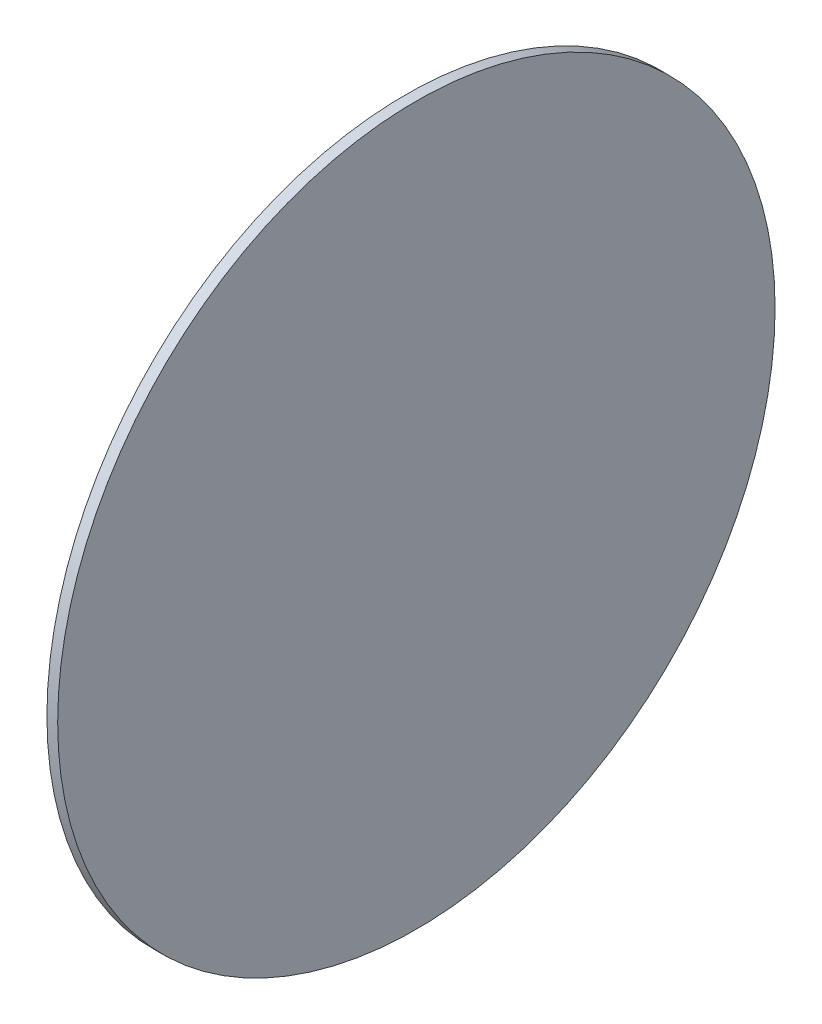
ISO-10303-21;
HEADER;
FILE_DESCRIPTION(('STEP AP214'),'2;1');
FILE_NAME('part.step','',(''),(''),'','','');
FILE_SCHEMA(('AUTOMOTIVE_DESIGN { 1 0 10303 214 1 1 1 1 }'));
ENDSEC;
DATA;
#1=APPLICATION_CONTEXT('core data for automotive mechanical design processes');
#2=APPLICATION_PROTOCOL_DEFINITION('international standard','automotive_design',2000,#1);
#3=PRODUCT_CONTEXT('',#1,'mechanical');
#4=PRODUCT('Part','Part','',(#3));
#5=PRODUCT_RELATED_PRODUCT_CATEGORY('part','',(#4));
#6=PRODUCT_DEFINITION_FORMATION('','',#4);
#7=PRODUCT_DEFINITION_CONTEXT('part definition',#1,'design');
#8=PRODUCT_DEFINITION('design','',#6,#7);
#9=PRODUCT_DEFINITION_SHAPE('','',#8);
#10=(LENGTH_UNIT() NAMED_UNIT(*) SI_UNIT(.MILLI.,.METRE.));
#11=(NAMED_UNIT(*) PLANE_ANGLE_UNIT() SI_UNIT($,.RADIAN.));
#12=(NAMED_UNIT(*) SI_UNIT($,.STERADIAN.) SOLID_ANGLE_UNIT());
#13=UNCERTAINTY_MEASURE_WITH_UNIT(LENGTH_MEASURE(1.E-05),#10,'distance_accuracy_value','');
#14=(GEOMETRIC_REPRESENTATION_CONTEXT(3) GLOBAL_UNCERTAINTY_ASSIGNED_CONTEXT((#13)) GLOBAL_UNIT_ASSIGNED_CONTEXT((#10,
#11,#12)) REPRESENTATION_CONTEXT('',''));
#15=CARTESIAN_POINT('',(0.,0.,0.));
#16=DIRECTION('',(0.,0.,1.));
#17=DIRECTION('',(1.,0.,0.));
#18=AXIS2_PLACEMENT_3D('',#15,#16,#17);
#19=CARTESIAN_POINT('',(3.,0.,0.));
#20=DIRECTION('',(-1.,0.,0.));
#21=DIRECTION('',(0.,0.,1.));
#22=AXIS2_PLACEMENT_3D('',#19,#20,#21);
#23=CYLINDRICAL_SURFACE('',#22,100.);
#24=CARTESIAN_POINT('',(3.,0.,0.));
#25=DIRECTION('',(1.,0.,0.));
#26=DIRECTION('',(0.,0.,-1.));
#27=AXIS2_PLACEMENT_3D('',#24,#25,#26);
#28=CIRCLE('',#27,100.);
#29=CARTESIAN_POINT('',(3.,0.,-100.));
#30=VERTEX_POINT('',#29);
#31=EDGE_CURVE('E10',#30,#30,#28,.T.);
#32=ORIENTED_EDGE('',*,*,#31,.F.);
#33=EDGE_LOOP('',(#32));
#34=FACE_BOUND('',#33,.T.);
#35=CARTESIAN_POINT('',(0.,0.,0.));
#36=DIRECTION('',(1.,0.,0.));
#37=DIRECTION('',(0.,0.,-1.));
#38=AXIS2_PLACEMENT_3D('',#35,#36,#37);
#39=CIRCLE('',#38,100.);
#40=CARTESIAN_POINT('',(0.,0.,-100.));
#41=VERTEX_POINT('',#40);
#42=EDGE_CURVE('E38',#41,#41,#39,.T.);
#43=ORIENTED_EDGE('',*,*,#42,.T.);
#44=EDGE_LOOP('',(#43));
#45=FACE_BOUND('',#44,.T.);
#46=ADVANCED_FACE('F35',(#34,#45),#23,.T.);
#47=CARTESIAN_POINT('',(3.,0.,0.));
#48=DIRECTION('',(1.,0.,0.));
#49=DIRECTION('',(0.,0.,-1.));
#50=AXIS2_PLACEMENT_3D('',#47,#48,#49);
#51=PLANE('',#50);
#52=ORIENTED_EDGE('',*,*,#31,.T.);
#53=EDGE_LOOP('',(#52));
#54=FACE_BOUND('',#53,.T.);
#55=ADVANCED_FACE('F50',(#54),#51,.T.);
#56=CARTESIAN_POINT('',(0.,0.,0.));
#57=DIRECTION('',(1.,0.,0.));
#58=DIRECTION('',(0.,0.,-1.));
#59=AXIS2_PLACEMENT_3D('',#56,#57,#58);
#60=PLANE('',#59);
#61=ORIENTED_EDGE('',*,*,#42,.F.);
#62=EDGE_LOOP('',(#61));
#63=FACE_BOUND('',#62,.T.);
#64=ADVANCED_FACE('F48',(#63),#60,.F.);
#65=CLOSED_SHELL('',(#46,#55,#64));
#66=MANIFOLD_SOLID_BREP('B2',#65);
#67=ADVANCED_BREP_SHAPE_REPRESENTATION('',(#18,#66),#14);
#68=SHAPE_DEFINITION_REPRESENTATION(#9,#67);
ENDSEC;
END-ISO-10303-21;
